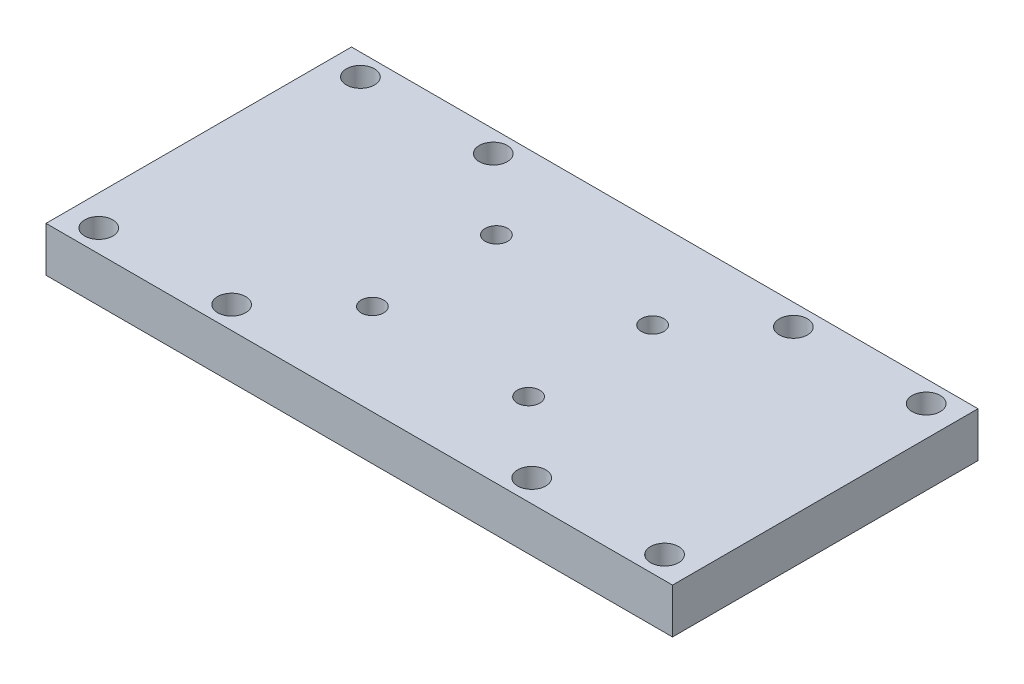
ISO-10303-21;
HEADER;
FILE_DESCRIPTION(('STEP AP214'),'2;1');
FILE_NAME('part.step','',(''),(''),'','','');
FILE_SCHEMA(('AUTOMOTIVE_DESIGN { 1 0 10303 214 1 1 1 1 }'));
ENDSEC;
DATA;
#1=APPLICATION_CONTEXT('core data for automotive mechanical design processes');
#2=APPLICATION_PROTOCOL_DEFINITION('international standard','automotive_design',2000,#1);
#3=PRODUCT_CONTEXT('',#1,'mechanical');
#4=PRODUCT('Part','Part','',(#3));
#5=PRODUCT_RELATED_PRODUCT_CATEGORY('part','',(#4));
#6=PRODUCT_DEFINITION_FORMATION('','',#4);
#7=PRODUCT_DEFINITION_CONTEXT('part definition',#1,'design');
#8=PRODUCT_DEFINITION('design','',#6,#7);
#9=PRODUCT_DEFINITION_SHAPE('','',#8);
#10=(LENGTH_UNIT() NAMED_UNIT(*) SI_UNIT(.MILLI.,.METRE.));
#11=(NAMED_UNIT(*) PLANE_ANGLE_UNIT() SI_UNIT($,.RADIAN.));
#12=(NAMED_UNIT(*) SI_UNIT($,.STERADIAN.) SOLID_ANGLE_UNIT());
#13=UNCERTAINTY_MEASURE_WITH_UNIT(LENGTH_MEASURE(1.E-05),#10,'distance_accuracy_value','');
#14=(GEOMETRIC_REPRESENTATION_CONTEXT(3) GLOBAL_UNCERTAINTY_ASSIGNED_CONTEXT((#13)) GLOBAL_UNIT_ASSIGNED_CONTEXT((#10,
#11,#12)) REPRESENTATION_CONTEXT('',''));
#15=CARTESIAN_POINT('',(0.,0.,0.));
#16=DIRECTION('',(0.,0.,1.));
#17=DIRECTION('',(1.,0.,0.));
#18=AXIS2_PLACEMENT_3D('',#15,#16,#17);
#19=CARTESIAN_POINT('',(0.,8.,0.));
#20=DIRECTION('',(0.,1.,0.));
#21=DIRECTION('',(0.,0.,1.));
#22=AXIS2_PLACEMENT_3D('',#19,#20,#21);
#23=PLANE('',#22);
#24=CARTESIAN_POINT('',(-79.9978790124663,8.,14.729057300876));
#25=DIRECTION('',(0.,1.,0.));
#26=DIRECTION('',(0.,0.,1.));
#27=AXIS2_PLACEMENT_3D('',#24,#25,#26);
#28=CIRCLE('',#27,2.5);
#29=CARTESIAN_POINT('',(-79.9978790124663,8.,17.229057300876));
#30=VERTEX_POINT('',#29);
#31=EDGE_CURVE('E212',#30,#30,#28,.T.);
#32=ORIENTED_EDGE('',*,*,#31,.F.);
#33=EDGE_LOOP('',(#32));
#34=FACE_BOUND('',#33,.T.);
#35=CARTESIAN_POINT('',(-56.3699968094504,8.,-31.8024230012127));
#36=DIRECTION('',(0.,1.,0.));
#37=DIRECTION('',(0.,0.,1.));
#38=AXIS2_PLACEMENT_3D('',#35,#36,#37);
#39=CIRCLE('',#38,2.5);
#40=CARTESIAN_POINT('',(-56.3699968094504,8.,-29.3024230012127));
#41=VERTEX_POINT('',#40);
#42=EDGE_CURVE('E196',#41,#41,#39,.T.);
#43=ORIENTED_EDGE('',*,*,#42,.F.);
#44=EDGE_LOOP('',(#43));
#45=FACE_BOUND('',#44,.T.);
#46=CARTESIAN_POINT('',(-15.7935070267108,8.,2.49220004075796));
#47=DIRECTION('',(0.,1.,0.));
#48=DIRECTION('',(0.,0.,1.));
#49=AXIS2_PLACEMENT_3D('',#46,#47,#48);
#50=CIRCLE('',#49,2.);
#51=CARTESIAN_POINT('',(-15.7935070267108,8.,4.49220004075796));
#52=VERTEX_POINT('',#51);
#53=EDGE_CURVE('E180',#52,#52,#50,.T.);
#54=ORIENTED_EDGE('',*,*,#53,.F.);
#55=EDGE_LOOP('',(#54));
#56=FACE_BOUND('',#55,.T.);
#57=CARTESIAN_POINT('',(-43.574368795206,8.,-19.5655657410947));
#58=DIRECTION('',(0.,1.,0.));
#59=DIRECTION('',(0.,0.,1.));
#60=AXIS2_PLACEMENT_3D('',#57,#58,#59);
#61=CIRCLE('',#60,2.);
#62=CARTESIAN_POINT('',(-43.574368795206,8.,-17.5655657410947));
#63=VERTEX_POINT('',#62);
#64=EDGE_CURVE('E164',#63,#63,#61,.T.);
#65=ORIENTED_EDGE('',*,*,#64,.F.);
#66=EDGE_LOOP('',(#65));
#67=FACE_BOUND('',#66,.T.);
#68=CARTESIAN_POINT('',(20.6300031905496,8.,14.729057300876));
#69=DIRECTION('',(0.,1.,0.));
#70=DIRECTION('',(0.,0.,1.));
#71=AXIS2_PLACEMENT_3D('',#68,#69,#70);
#72=CIRCLE('',#71,2.5);
#73=CARTESIAN_POINT('',(20.6300031905496,8.,17.229057300876));
#74=VERTEX_POINT('',#73);
#75=EDGE_CURVE('E148',#74,#74,#72,.T.);
#76=ORIENTED_EDGE('',*,*,#75,.F.);
#77=EDGE_LOOP('',(#76));
#78=FACE_BOUND('',#77,.T.);
#79=CARTESIAN_POINT('',(20.6300031905496,8.,-31.8024230012127));
#80=DIRECTION('',(0.,1.,0.));
#81=DIRECTION('',(0.,0.,1.));
#82=AXIS2_PLACEMENT_3D('',#79,#80,#81);
#83=CIRCLE('',#82,2.5);
#84=CARTESIAN_POINT('',(20.6300031905496,8.,-29.3024230012127));
#85=VERTEX_POINT('',#84);
#86=EDGE_CURVE('E118',#85,#85,#83,.T.);
#87=ORIENTED_EDGE('',*,*,#86,.F.);
#88=EDGE_LOOP('',(#87));
#89=FACE_BOUND('',#88,.T.);
#90=DIRECTION('',(0.,0.,1.));
#91=VECTOR('',#90,1.);
#92=CARTESIAN_POINT('',(-85.3968571301176,8.,-35.6145457625858));
#93=LINE('',#92,#91);
#94=CARTESIAN_POINT('',(-85.3968571301176,8.,-35.6145457625858));
#95=VERTEX_POINT('',#94);
#96=CARTESIAN_POINT('',(-85.3968571301176,8.,18.7142015505074));
#97=VERTEX_POINT('',#96);
#98=EDGE_CURVE('E98',#95,#97,#93,.T.);
#99=ORIENTED_EDGE('',*,*,#98,.T.);
#100=DIRECTION('',(1.,0.,0.));
#101=VECTOR('',#100,1.);
#102=CARTESIAN_POINT('',(-85.3968571301176,8.,18.7142015505074));
#103=LINE('',#102,#101);
#104=CARTESIAN_POINT('',(26.0289813082009,8.,18.7142015505074));
#105=VERTEX_POINT('',#104);
#106=EDGE_CURVE('E93',#97,#105,#103,.T.);
#107=ORIENTED_EDGE('',*,*,#106,.T.);
#108=DIRECTION('',(0.,0.,-1.));
#109=VECTOR('',#108,1.);
#110=CARTESIAN_POINT('',(26.0289813082009,8.,-35.6145457625858));
#111=LINE('',#110,#109);
#112=CARTESIAN_POINT('',(26.0289813082009,8.,-35.6145457625858));
#113=VERTEX_POINT('',#112);
#114=EDGE_CURVE('E96',#105,#113,#111,.T.);
#115=ORIENTED_EDGE('',*,*,#114,.T.);
#116=DIRECTION('',(-1.,0.,0.));
#117=VECTOR('',#116,1.);
#118=CARTESIAN_POINT('',(-85.3968571301176,8.,-35.6145457625858));
#119=LINE('',#118,#117);
#120=EDGE_CURVE('E63',#113,#95,#119,.T.);
#121=ORIENTED_EDGE('',*,*,#120,.T.);
#122=EDGE_LOOP('',(#99,#107,#115,#121));
#123=FACE_BOUND('',#122,.T.);
#124=CARTESIAN_POINT('',(-2.99787901246631,8.,-31.8024230012127));
#125=DIRECTION('',(0.,1.,0.));
#126=DIRECTION('',(0.,0.,1.));
#127=AXIS2_PLACEMENT_3D('',#124,#125,#126);
#128=CIRCLE('',#127,2.5);
#129=CARTESIAN_POINT('',(-2.99787901246631,8.,-29.3024230012127));
#130=VERTEX_POINT('',#129);
#131=EDGE_CURVE('E140',#130,#130,#128,.T.);
#132=ORIENTED_EDGE('',*,*,#131,.F.);
#133=EDGE_LOOP('',(#132));
#134=FACE_BOUND('',#133,.T.);
#135=CARTESIAN_POINT('',(-2.99787901246631,8.,14.729057300876));
#136=DIRECTION('',(0.,1.,0.));
#137=DIRECTION('',(0.,0.,1.));
#138=AXIS2_PLACEMENT_3D('',#135,#136,#137);
#139=CIRCLE('',#138,2.5);
#140=CARTESIAN_POINT('',(-2.99787901246631,8.,17.229057300876));
#141=VERTEX_POINT('',#140);
#142=EDGE_CURVE('E156',#141,#141,#139,.T.);
#143=ORIENTED_EDGE('',*,*,#142,.F.);
#144=EDGE_LOOP('',(#143));
#145=FACE_BOUND('',#144,.T.);
#146=CARTESIAN_POINT('',(-15.7935070267108,8.,-19.5655657410947));
#147=DIRECTION('',(0.,1.,0.));
#148=DIRECTION('',(0.,0.,1.));
#149=AXIS2_PLACEMENT_3D('',#146,#147,#148);
#150=CIRCLE('',#149,2.);
#151=CARTESIAN_POINT('',(-15.7935070267108,8.,-17.5655657410947));
#152=VERTEX_POINT('',#151);
#153=EDGE_CURVE('E172',#152,#152,#150,.T.);
#154=ORIENTED_EDGE('',*,*,#153,.F.);
#155=EDGE_LOOP('',(#154));
#156=FACE_BOUND('',#155,.T.);
#157=CARTESIAN_POINT('',(-43.574368795206,8.,2.49220004075796));
#158=DIRECTION('',(0.,1.,0.));
#159=DIRECTION('',(0.,0.,1.));
#160=AXIS2_PLACEMENT_3D('',#157,#158,#159);
#161=CIRCLE('',#160,2.);
#162=CARTESIAN_POINT('',(-43.574368795206,8.,4.49220004075796));
#163=VERTEX_POINT('',#162);
#164=EDGE_CURVE('E188',#163,#163,#161,.T.);
#165=ORIENTED_EDGE('',*,*,#164,.F.);
#166=EDGE_LOOP('',(#165));
#167=FACE_BOUND('',#166,.T.);
#168=CARTESIAN_POINT('',(-79.9978790124663,8.,-31.8024230012127));
#169=DIRECTION('',(0.,1.,0.));
#170=DIRECTION('',(0.,0.,1.));
#171=AXIS2_PLACEMENT_3D('',#168,#169,#170);
#172=CIRCLE('',#171,2.50000000000001);
#173=CARTESIAN_POINT('',(-79.9978790124663,8.,-29.3024230012127));
#174=VERTEX_POINT('',#173);
#175=EDGE_CURVE('E204',#174,#174,#172,.T.);
#176=ORIENTED_EDGE('',*,*,#175,.F.);
#177=EDGE_LOOP('',(#176));
#178=FACE_BOUND('',#177,.T.);
#179=CARTESIAN_POINT('',(-56.3699968094504,8.,14.729057300876));
#180=DIRECTION('',(0.,1.,0.));
#181=DIRECTION('',(0.,0.,1.));
#182=AXIS2_PLACEMENT_3D('',#179,#180,#181);
#183=CIRCLE('',#182,2.5);
#184=CARTESIAN_POINT('',(-56.3699968094504,8.,17.229057300876));
#185=VERTEX_POINT('',#184);
#186=EDGE_CURVE('E220',#185,#185,#183,.T.);
#187=ORIENTED_EDGE('',*,*,#186,.F.);
#188=EDGE_LOOP('',(#187));
#189=FACE_BOUND('',#188,.T.);
#190=ADVANCED_FACE('F45',(#34,#45,#56,#67,#78,#89,#123,#134,#145,#156,#167,#178,#189),#23,.T.);
#191=CARTESIAN_POINT('',(0.,0.,0.));
#192=DIRECTION('',(0.,1.,0.));
#193=DIRECTION('',(0.,0.,1.));
#194=AXIS2_PLACEMENT_3D('',#191,#192,#193);
#195=PLANE('',#194);
#196=DIRECTION('',(0.,0.,1.));
#197=VECTOR('',#196,1.);
#198=CARTESIAN_POINT('',(-85.3968571301176,0.,-35.6145457625858));
#199=LINE('',#198,#197);
#200=CARTESIAN_POINT('',(-85.3968571301176,0.,-35.6145457625858));
#201=VERTEX_POINT('',#200);
#202=CARTESIAN_POINT('',(-85.3968571301176,0.,18.7142015505074));
#203=VERTEX_POINT('',#202);
#204=EDGE_CURVE('E114',#201,#203,#199,.T.);
#205=ORIENTED_EDGE('',*,*,#204,.F.);
#206=DIRECTION('',(-1.,0.,0.));
#207=VECTOR('',#206,1.);
#208=CARTESIAN_POINT('',(-85.3968571301176,0.,-35.6145457625858));
#209=LINE('',#208,#207);
#210=CARTESIAN_POINT('',(26.0289813082009,0.,-35.6145457625858));
#211=VERTEX_POINT('',#210);
#212=EDGE_CURVE('E86',#211,#201,#209,.T.);
#213=ORIENTED_EDGE('',*,*,#212,.F.);
#214=DIRECTION('',(0.,0.,-1.));
#215=VECTOR('',#214,1.);
#216=CARTESIAN_POINT('',(26.0289813082009,0.,-35.6145457625858));
#217=LINE('',#216,#215);
#218=CARTESIAN_POINT('',(26.0289813082009,0.,18.7142015505074));
#219=VERTEX_POINT('',#218);
#220=EDGE_CURVE('E80',#219,#211,#217,.T.);
#221=ORIENTED_EDGE('',*,*,#220,.F.);
#222=DIRECTION('',(1.,0.,0.));
#223=VECTOR('',#222,1.);
#224=CARTESIAN_POINT('',(-85.3968571301176,0.,18.7142015505074));
#225=LINE('',#224,#223);
#226=EDGE_CURVE('E103',#203,#219,#225,.T.);
#227=ORIENTED_EDGE('',*,*,#226,.F.);
#228=EDGE_LOOP('',(#205,#213,#221,#227));
#229=FACE_BOUND('',#228,.T.);
#230=CARTESIAN_POINT('',(20.6300031905496,0.,-31.8024230012127));
#231=DIRECTION('',(0.,1.,0.));
#232=DIRECTION('',(0.,0.,1.));
#233=AXIS2_PLACEMENT_3D('',#230,#231,#232);
#234=CIRCLE('',#233,2.5);
#235=CARTESIAN_POINT('',(20.6300031905496,0.,-29.3024230012127));
#236=VERTEX_POINT('',#235);
#237=EDGE_CURVE('E136',#236,#236,#234,.T.);
#238=ORIENTED_EDGE('',*,*,#237,.T.);
#239=EDGE_LOOP('',(#238));
#240=FACE_BOUND('',#239,.T.);
#241=CARTESIAN_POINT('',(-2.99787901246631,0.,-31.8024230012127));
#242=DIRECTION('',(0.,1.,0.));
#243=DIRECTION('',(0.,0.,1.));
#244=AXIS2_PLACEMENT_3D('',#241,#242,#243);
#245=CIRCLE('',#244,2.5);
#246=CARTESIAN_POINT('',(-2.99787901246631,0.,-29.3024230012127));
#247=VERTEX_POINT('',#246);
#248=EDGE_CURVE('E144',#247,#247,#245,.T.);
#249=ORIENTED_EDGE('',*,*,#248,.T.);
#250=EDGE_LOOP('',(#249));
#251=FACE_BOUND('',#250,.T.);
#252=CARTESIAN_POINT('',(20.6300031905496,0.,14.729057300876));
#253=DIRECTION('',(0.,1.,0.));
#254=DIRECTION('',(0.,0.,1.));
#255=AXIS2_PLACEMENT_3D('',#252,#253,#254);
#256=CIRCLE('',#255,2.5);
#257=CARTESIAN_POINT('',(20.6300031905496,0.,17.229057300876));
#258=VERTEX_POINT('',#257);
#259=EDGE_CURVE('E152',#258,#258,#256,.T.);
#260=ORIENTED_EDGE('',*,*,#259,.T.);
#261=EDGE_LOOP('',(#260));
#262=FACE_BOUND('',#261,.T.);
#263=CARTESIAN_POINT('',(-2.99787901246631,0.,14.729057300876));
#264=DIRECTION('',(0.,1.,0.));
#265=DIRECTION('',(0.,0.,1.));
#266=AXIS2_PLACEMENT_3D('',#263,#264,#265);
#267=CIRCLE('',#266,2.5);
#268=CARTESIAN_POINT('',(-2.99787901246631,0.,17.229057300876));
#269=VERTEX_POINT('',#268);
#270=EDGE_CURVE('E160',#269,#269,#267,.T.);
#271=ORIENTED_EDGE('',*,*,#270,.T.);
#272=EDGE_LOOP('',(#271));
#273=FACE_BOUND('',#272,.T.);
#274=CARTESIAN_POINT('',(-43.574368795206,0.,-19.5655657410947));
#275=DIRECTION('',(0.,1.,0.));
#276=DIRECTION('',(0.,0.,1.));
#277=AXIS2_PLACEMENT_3D('',#274,#275,#276);
#278=CIRCLE('',#277,2.);
#279=CARTESIAN_POINT('',(-43.574368795206,0.,-17.5655657410947));
#280=VERTEX_POINT('',#279);
#281=EDGE_CURVE('E168',#280,#280,#278,.T.);
#282=ORIENTED_EDGE('',*,*,#281,.T.);
#283=EDGE_LOOP('',(#282));
#284=FACE_BOUND('',#283,.T.);
#285=CARTESIAN_POINT('',(-15.7935070267108,0.,-19.5655657410947));
#286=DIRECTION('',(0.,1.,0.));
#287=DIRECTION('',(0.,0.,1.));
#288=AXIS2_PLACEMENT_3D('',#285,#286,#287);
#289=CIRCLE('',#288,2.);
#290=CARTESIAN_POINT('',(-15.7935070267108,0.,-17.5655657410947));
#291=VERTEX_POINT('',#290);
#292=EDGE_CURVE('E176',#291,#291,#289,.T.);
#293=ORIENTED_EDGE('',*,*,#292,.T.);
#294=EDGE_LOOP('',(#293));
#295=FACE_BOUND('',#294,.T.);
#296=CARTESIAN_POINT('',(-15.7935070267108,0.,2.49220004075796));
#297=DIRECTION('',(0.,1.,0.));
#298=DIRECTION('',(0.,0.,1.));
#299=AXIS2_PLACEMENT_3D('',#296,#297,#298);
#300=CIRCLE('',#299,2.);
#301=CARTESIAN_POINT('',(-15.7935070267108,0.,4.49220004075796));
#302=VERTEX_POINT('',#301);
#303=EDGE_CURVE('E184',#302,#302,#300,.T.);
#304=ORIENTED_EDGE('',*,*,#303,.T.);
#305=EDGE_LOOP('',(#304));
#306=FACE_BOUND('',#305,.T.);
#307=CARTESIAN_POINT('',(-43.574368795206,0.,2.49220004075796));
#308=DIRECTION('',(0.,1.,0.));
#309=DIRECTION('',(0.,0.,1.));
#310=AXIS2_PLACEMENT_3D('',#307,#308,#309);
#311=CIRCLE('',#310,2.);
#312=CARTESIAN_POINT('',(-43.574368795206,0.,4.49220004075796));
#313=VERTEX_POINT('',#312);
#314=EDGE_CURVE('E192',#313,#313,#311,.T.);
#315=ORIENTED_EDGE('',*,*,#314,.T.);
#316=EDGE_LOOP('',(#315));
#317=FACE_BOUND('',#316,.T.);
#318=CARTESIAN_POINT('',(-56.3699968094504,0.,-31.8024230012127));
#319=DIRECTION('',(0.,1.,0.));
#320=DIRECTION('',(0.,0.,1.));
#321=AXIS2_PLACEMENT_3D('',#318,#319,#320);
#322=CIRCLE('',#321,2.5);
#323=CARTESIAN_POINT('',(-56.3699968094504,0.,-29.3024230012127));
#324=VERTEX_POINT('',#323);
#325=EDGE_CURVE('E200',#324,#324,#322,.T.);
#326=ORIENTED_EDGE('',*,*,#325,.T.);
#327=EDGE_LOOP('',(#326));
#328=FACE_BOUND('',#327,.T.);
#329=CARTESIAN_POINT('',(-79.9978790124663,0.,-31.8024230012127));
#330=DIRECTION('',(0.,1.,0.));
#331=DIRECTION('',(0.,0.,1.));
#332=AXIS2_PLACEMENT_3D('',#329,#330,#331);
#333=CIRCLE('',#332,2.50000000000001);
#334=CARTESIAN_POINT('',(-79.9978790124663,0.,-29.3024230012127));
#335=VERTEX_POINT('',#334);
#336=EDGE_CURVE('E208',#335,#335,#333,.T.);
#337=ORIENTED_EDGE('',*,*,#336,.T.);
#338=EDGE_LOOP('',(#337));
#339=FACE_BOUND('',#338,.T.);
#340=CARTESIAN_POINT('',(-79.9978790124663,0.,14.729057300876));
#341=DIRECTION('',(0.,1.,0.));
#342=DIRECTION('',(0.,0.,1.));
#343=AXIS2_PLACEMENT_3D('',#340,#341,#342);
#344=CIRCLE('',#343,2.5);
#345=CARTESIAN_POINT('',(-79.9978790124663,0.,17.229057300876));
#346=VERTEX_POINT('',#345);
#347=EDGE_CURVE('E216',#346,#346,#344,.T.);
#348=ORIENTED_EDGE('',*,*,#347,.T.);
#349=EDGE_LOOP('',(#348));
#350=FACE_BOUND('',#349,.T.);
#351=CARTESIAN_POINT('',(-56.3699968094504,0.,14.729057300876));
#352=DIRECTION('',(0.,1.,0.));
#353=DIRECTION('',(0.,0.,1.));
#354=AXIS2_PLACEMENT_3D('',#351,#352,#353);
#355=CIRCLE('',#354,2.5);
#356=CARTESIAN_POINT('',(-56.3699968094504,0.,17.229057300876));
#357=VERTEX_POINT('',#356);
#358=EDGE_CURVE('E224',#357,#357,#355,.T.);
#359=ORIENTED_EDGE('',*,*,#358,.T.);
#360=EDGE_LOOP('',(#359));
#361=FACE_BOUND('',#360,.T.);
#362=ADVANCED_FACE('F131',(#229,#240,#251,#262,#273,#284,#295,#306,#317,#328,#339,#350,#361),
#195,.F.);
#363=CARTESIAN_POINT('',(-85.3968571301176,8.,-35.6145457625858));
#364=DIRECTION('',(1.,0.,0.));
#365=DIRECTION('',(0.,0.,-1.));
#366=AXIS2_PLACEMENT_3D('',#363,#364,#365);
#367=PLANE('',#366);
#368=ORIENTED_EDGE('',*,*,#204,.T.);
#369=DIRECTION('',(0.,-1.,0.));
#370=VECTOR('',#369,1.);
#371=CARTESIAN_POINT('',(-85.3968571301176,8.,18.7142015505074));
#372=LINE('',#371,#370);
#373=EDGE_CURVE('E11',#97,#203,#372,.T.);
#374=ORIENTED_EDGE('',*,*,#373,.F.);
#375=ORIENTED_EDGE('',*,*,#98,.F.);
#376=DIRECTION('',(0.,-1.,0.));
#377=VECTOR('',#376,1.);
#378=CARTESIAN_POINT('',(-85.3968571301176,8.,-35.6145457625858));
#379=LINE('',#378,#377);
#380=EDGE_CURVE('E110',#95,#201,#379,.T.);
#381=ORIENTED_EDGE('',*,*,#380,.T.);
#382=EDGE_LOOP('',(#368,#374,#375,#381));
#383=FACE_BOUND('',#382,.T.);
#384=ADVANCED_FACE('F47',(#383),#367,.F.);
#385=CARTESIAN_POINT('',(-85.3968571301176,8.,18.7142015505074));
#386=DIRECTION('',(0.,0.,-1.));
#387=DIRECTION('',(-1.,0.,0.));
#388=AXIS2_PLACEMENT_3D('',#385,#386,#387);
#389=PLANE('',#388);
#390=ORIENTED_EDGE('',*,*,#226,.T.);
#391=DIRECTION('',(0.,-1.,0.));
#392=VECTOR('',#391,1.);
#393=CARTESIAN_POINT('',(26.0289813082009,8.,18.7142015505074));
#394=LINE('',#393,#392);
#395=EDGE_CURVE('E55',#105,#219,#394,.T.);
#396=ORIENTED_EDGE('',*,*,#395,.F.);
#397=ORIENTED_EDGE('',*,*,#106,.F.);
#398=ORIENTED_EDGE('',*,*,#373,.T.);
#399=EDGE_LOOP('',(#390,#396,#397,#398));
#400=FACE_BOUND('',#399,.T.);
#401=ADVANCED_FACE('F102',(#400),#389,.F.);
#402=CARTESIAN_POINT('',(26.0289813082009,8.,-35.6145457625858));
#403=DIRECTION('',(-1.,0.,0.));
#404=DIRECTION('',(0.,0.,1.));
#405=AXIS2_PLACEMENT_3D('',#402,#403,#404);
#406=PLANE('',#405);
#407=ORIENTED_EDGE('',*,*,#220,.T.);
#408=DIRECTION('',(0.,-1.,0.));
#409=VECTOR('',#408,1.);
#410=CARTESIAN_POINT('',(26.0289813082009,8.,-35.6145457625858));
#411=LINE('',#410,#409);
#412=EDGE_CURVE('E105',#113,#211,#411,.T.);
#413=ORIENTED_EDGE('',*,*,#412,.F.);
#414=ORIENTED_EDGE('',*,*,#114,.F.);
#415=ORIENTED_EDGE('',*,*,#395,.T.);
#416=EDGE_LOOP('',(#407,#413,#414,#415));
#417=FACE_BOUND('',#416,.T.);
#418=ADVANCED_FACE('F106',(#417),#406,.F.);
#419=CARTESIAN_POINT('',(-85.3968571301176,8.,-35.6145457625858));
#420=DIRECTION('',(0.,0.,1.));
#421=DIRECTION('',(1.,0.,0.));
#422=AXIS2_PLACEMENT_3D('',#419,#420,#421);
#423=PLANE('',#422);
#424=ORIENTED_EDGE('',*,*,#212,.T.);
#425=ORIENTED_EDGE('',*,*,#380,.F.);
#426=ORIENTED_EDGE('',*,*,#120,.F.);
#427=ORIENTED_EDGE('',*,*,#412,.T.);
#428=EDGE_LOOP('',(#424,#425,#426,#427));
#429=FACE_BOUND('',#428,.T.);
#430=ADVANCED_FACE('F128',(#429),#423,.F.);
#431=CARTESIAN_POINT('',(20.6300031905496,8.,-31.8024230012127));
#432=DIRECTION('',(0.,-1.,0.));
#433=DIRECTION('',(0.,0.,-1.));
#434=AXIS2_PLACEMENT_3D('',#431,#432,#433);
#435=CYLINDRICAL_SURFACE('',#434,2.5);
#436=ORIENTED_EDGE('',*,*,#86,.T.);
#437=EDGE_LOOP('',(#436));
#438=FACE_BOUND('',#437,.T.);
#439=ORIENTED_EDGE('',*,*,#237,.F.);
#440=EDGE_LOOP('',(#439));
#441=FACE_BOUND('',#440,.T.);
#442=ADVANCED_FACE('F245',(#438,#441),#435,.F.);
#443=CARTESIAN_POINT('',(-2.99787901246631,8.,-31.8024230012127));
#444=DIRECTION('',(0.,-1.,0.));
#445=DIRECTION('',(0.,0.,-1.));
#446=AXIS2_PLACEMENT_3D('',#443,#444,#445);
#447=CYLINDRICAL_SURFACE('',#446,2.5);
#448=ORIENTED_EDGE('',*,*,#131,.T.);
#449=EDGE_LOOP('',(#448));
#450=FACE_BOUND('',#449,.T.);
#451=ORIENTED_EDGE('',*,*,#248,.F.);
#452=EDGE_LOOP('',(#451));
#453=FACE_BOUND('',#452,.T.);
#454=ADVANCED_FACE('F280',(#450,#453),#447,.F.);
#455=CARTESIAN_POINT('',(20.6300031905496,8.,14.729057300876));
#456=DIRECTION('',(0.,-1.,0.));
#457=DIRECTION('',(0.,0.,-1.));
#458=AXIS2_PLACEMENT_3D('',#455,#456,#457);
#459=CYLINDRICAL_SURFACE('',#458,2.5);
#460=ORIENTED_EDGE('',*,*,#75,.T.);
#461=EDGE_LOOP('',(#460));
#462=FACE_BOUND('',#461,.T.);
#463=ORIENTED_EDGE('',*,*,#259,.F.);
#464=EDGE_LOOP('',(#463));
#465=FACE_BOUND('',#464,.T.);
#466=ADVANCED_FACE('F287',(#462,#465),#459,.F.);
#467=CARTESIAN_POINT('',(-2.99787901246631,8.,14.729057300876));
#468=DIRECTION('',(0.,-1.,0.));
#469=DIRECTION('',(0.,0.,-1.));
#470=AXIS2_PLACEMENT_3D('',#467,#468,#469);
#471=CYLINDRICAL_SURFACE('',#470,2.5);
#472=ORIENTED_EDGE('',*,*,#142,.T.);
#473=EDGE_LOOP('',(#472));
#474=FACE_BOUND('',#473,.T.);
#475=ORIENTED_EDGE('',*,*,#270,.F.);
#476=EDGE_LOOP('',(#475));
#477=FACE_BOUND('',#476,.T.);
#478=ADVANCED_FACE('F294',(#474,#477),#471,.F.);
#479=CARTESIAN_POINT('',(-43.574368795206,8.,-19.5655657410947));
#480=DIRECTION('',(0.,-1.,0.));
#481=DIRECTION('',(0.,0.,-1.));
#482=AXIS2_PLACEMENT_3D('',#479,#480,#481);
#483=CYLINDRICAL_SURFACE('',#482,2.);
#484=ORIENTED_EDGE('',*,*,#64,.T.);
#485=EDGE_LOOP('',(#484));
#486=FACE_BOUND('',#485,.T.);
#487=ORIENTED_EDGE('',*,*,#281,.F.);
#488=EDGE_LOOP('',(#487));
#489=FACE_BOUND('',#488,.T.);
#490=ADVANCED_FACE('F302',(#486,#489),#483,.F.);
#491=CARTESIAN_POINT('',(-15.7935070267108,8.,-19.5655657410947));
#492=DIRECTION('',(0.,-1.,0.));
#493=DIRECTION('',(0.,0.,-1.));
#494=AXIS2_PLACEMENT_3D('',#491,#492,#493);
#495=CYLINDRICAL_SURFACE('',#494,2.);
#496=ORIENTED_EDGE('',*,*,#153,.T.);
#497=EDGE_LOOP('',(#496));
#498=FACE_BOUND('',#497,.T.);
#499=ORIENTED_EDGE('',*,*,#292,.F.);
#500=EDGE_LOOP('',(#499));
#501=FACE_BOUND('',#500,.T.);
#502=ADVANCED_FACE('F310',(#498,#501),#495,.F.);
#503=CARTESIAN_POINT('',(-15.7935070267108,8.,2.49220004075796));
#504=DIRECTION('',(0.,-1.,0.));
#505=DIRECTION('',(0.,0.,-1.));
#506=AXIS2_PLACEMENT_3D('',#503,#504,#505);
#507=CYLINDRICAL_SURFACE('',#506,2.);
#508=ORIENTED_EDGE('',*,*,#53,.T.);
#509=EDGE_LOOP('',(#508));
#510=FACE_BOUND('',#509,.T.);
#511=ORIENTED_EDGE('',*,*,#303,.F.);
#512=EDGE_LOOP('',(#511));
#513=FACE_BOUND('',#512,.T.);
#514=ADVANCED_FACE('F318',(#510,#513),#507,.F.);
#515=CARTESIAN_POINT('',(-43.574368795206,8.,2.49220004075796));
#516=DIRECTION('',(0.,-1.,0.));
#517=DIRECTION('',(0.,0.,-1.));
#518=AXIS2_PLACEMENT_3D('',#515,#516,#517);
#519=CYLINDRICAL_SURFACE('',#518,2.);
#520=ORIENTED_EDGE('',*,*,#164,.T.);
#521=EDGE_LOOP('',(#520));
#522=FACE_BOUND('',#521,.T.);
#523=ORIENTED_EDGE('',*,*,#314,.F.);
#524=EDGE_LOOP('',(#523));
#525=FACE_BOUND('',#524,.T.);
#526=ADVANCED_FACE('F326',(#522,#525),#519,.F.);
#527=CARTESIAN_POINT('',(-56.3699968094504,8.,-31.8024230012127));
#528=DIRECTION('',(0.,-1.,0.));
#529=DIRECTION('',(0.,0.,-1.));
#530=AXIS2_PLACEMENT_3D('',#527,#528,#529);
#531=CYLINDRICAL_SURFACE('',#530,2.5);
#532=ORIENTED_EDGE('',*,*,#42,.T.);
#533=EDGE_LOOP('',(#532));
#534=FACE_BOUND('',#533,.T.);
#535=ORIENTED_EDGE('',*,*,#325,.F.);
#536=EDGE_LOOP('',(#535));
#537=FACE_BOUND('',#536,.T.);
#538=ADVANCED_FACE('F334',(#534,#537),#531,.F.);
#539=CARTESIAN_POINT('',(-79.9978790124663,8.,-31.8024230012127));
#540=DIRECTION('',(0.,-1.,0.));
#541=DIRECTION('',(0.,0.,-1.));
#542=AXIS2_PLACEMENT_3D('',#539,#540,#541);
#543=CYLINDRICAL_SURFACE('',#542,2.50000000000001);
#544=ORIENTED_EDGE('',*,*,#175,.T.);
#545=EDGE_LOOP('',(#544));
#546=FACE_BOUND('',#545,.T.);
#547=ORIENTED_EDGE('',*,*,#336,.F.);
#548=EDGE_LOOP('',(#547));
#549=FACE_BOUND('',#548,.T.);
#550=ADVANCED_FACE('F342',(#546,#549),#543,.F.);
#551=CARTESIAN_POINT('',(-79.9978790124663,8.,14.729057300876));
#552=DIRECTION('',(0.,-1.,0.));
#553=DIRECTION('',(0.,0.,-1.));
#554=AXIS2_PLACEMENT_3D('',#551,#552,#553);
#555=CYLINDRICAL_SURFACE('',#554,2.5);
#556=ORIENTED_EDGE('',*,*,#31,.T.);
#557=EDGE_LOOP('',(#556));
#558=FACE_BOUND('',#557,.T.);
#559=ORIENTED_EDGE('',*,*,#347,.F.);
#560=EDGE_LOOP('',(#559));
#561=FACE_BOUND('',#560,.T.);
#562=ADVANCED_FACE('F350',(#558,#561),#555,.F.);
#563=CARTESIAN_POINT('',(-56.3699968094504,8.,14.729057300876));
#564=DIRECTION('',(0.,-1.,0.));
#565=DIRECTION('',(0.,0.,-1.));
#566=AXIS2_PLACEMENT_3D('',#563,#564,#565);
#567=CYLINDRICAL_SURFACE('',#566,2.5);
#568=ORIENTED_EDGE('',*,*,#186,.T.);
#569=EDGE_LOOP('',(#568));
#570=FACE_BOUND('',#569,.T.);
#571=ORIENTED_EDGE('',*,*,#358,.F.);
#572=EDGE_LOOP('',(#571));
#573=FACE_BOUND('',#572,.T.);
#574=ADVANCED_FACE('F232',(#570,#573),#567,.F.);
#575=CLOSED_SHELL('',(#190,#362,#384,#401,#418,#430,#442,#454,#466,#478,#490,#502,#514,#526,
#538,#550,#562,#574));
#576=MANIFOLD_SOLID_BREP('B2',#575);
#577=ADVANCED_BREP_SHAPE_REPRESENTATION('',(#18,#576),#14);
#578=SHAPE_DEFINITION_REPRESENTATION(#9,#577);
ENDSEC;
END-ISO-10303-21;
